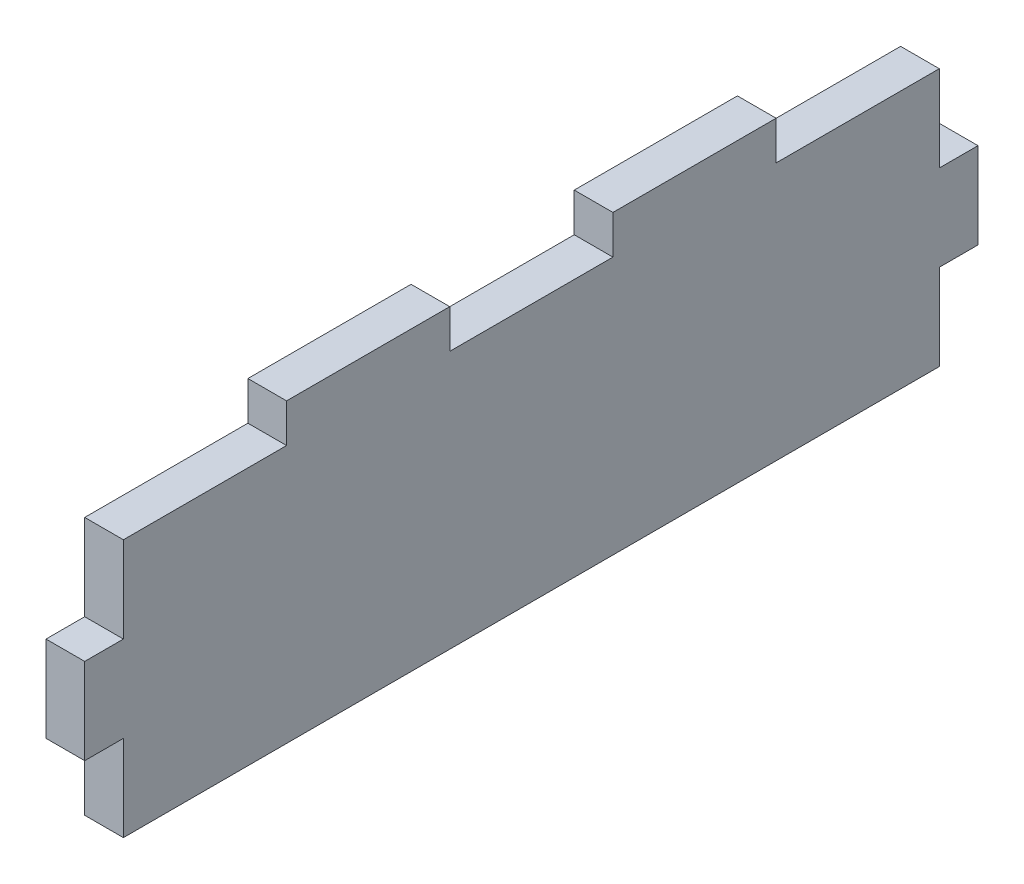
ISO-10303-21;
HEADER;
FILE_DESCRIPTION(('STEP AP214'),'2;1');
FILE_NAME('part.step','',(''),(''),'','','');
FILE_SCHEMA(('AUTOMOTIVE_DESIGN { 1 0 10303 214 1 1 1 1 }'));
ENDSEC;
DATA;
#1=APPLICATION_CONTEXT('core data for automotive mechanical design processes');
#2=APPLICATION_PROTOCOL_DEFINITION('international standard','automotive_design',2000,#1);
#3=PRODUCT_CONTEXT('',#1,'mechanical');
#4=PRODUCT('Part','Part','',(#3));
#5=PRODUCT_RELATED_PRODUCT_CATEGORY('part','',(#4));
#6=PRODUCT_DEFINITION_FORMATION('','',#4);
#7=PRODUCT_DEFINITION_CONTEXT('part definition',#1,'design');
#8=PRODUCT_DEFINITION('design','',#6,#7);
#9=PRODUCT_DEFINITION_SHAPE('','',#8);
#10=(LENGTH_UNIT() NAMED_UNIT(*) SI_UNIT(.MILLI.,.METRE.));
#11=(NAMED_UNIT(*) PLANE_ANGLE_UNIT() SI_UNIT($,.RADIAN.));
#12=(NAMED_UNIT(*) SI_UNIT($,.STERADIAN.) SOLID_ANGLE_UNIT());
#13=UNCERTAINTY_MEASURE_WITH_UNIT(LENGTH_MEASURE(1.E-05),#10,'distance_accuracy_value','');
#14=(GEOMETRIC_REPRESENTATION_CONTEXT(3) GLOBAL_UNCERTAINTY_ASSIGNED_CONTEXT((#13)) GLOBAL_UNIT_ASSIGNED_CONTEXT((#10,
#11,#12)) REPRESENTATION_CONTEXT('',''));
#15=CARTESIAN_POINT('',(0.,0.,0.));
#16=DIRECTION('',(0.,0.,1.));
#17=DIRECTION('',(1.,0.,0.));
#18=AXIS2_PLACEMENT_3D('',#15,#16,#17);
#19=CARTESIAN_POINT('',(-207.5,6.,-63.25));
#20=DIRECTION('',(0.,0.,1.));
#21=DIRECTION('',(1.,0.,0.));
#22=AXIS2_PLACEMENT_3D('',#19,#20,#21);
#23=PLANE('',#22);
#24=DIRECTION('',(0.,1.,0.));
#25=VECTOR('',#24,1.);
#26=CARTESIAN_POINT('',(-213.5,-34.,-63.25));
#27=LINE('',#26,#25);
#28=CARTESIAN_POINT('',(-213.5,-34.,-63.25));
#29=VERTEX_POINT('',#28);
#30=CARTESIAN_POINT('',(-213.5,-20.6666666666667,-63.25));
#31=VERTEX_POINT('',#30);
#32=EDGE_CURVE('E308',#29,#31,#27,.T.);
#33=ORIENTED_EDGE('',*,*,#32,.T.);
#34=DIRECTION('',(1.,0.,0.));
#35=VECTOR('',#34,1.);
#36=CARTESIAN_POINT('',(0.,-20.6666666666667,-63.25));
#37=LINE('',#36,#35);
#38=CARTESIAN_POINT('',(-207.5,-20.6666666666667,-63.25));
#39=VERTEX_POINT('',#38);
#40=EDGE_CURVE('E191',#31,#39,#37,.T.);
#41=ORIENTED_EDGE('',*,*,#40,.T.);
#42=DIRECTION('',(0.,1.,0.));
#43=VECTOR('',#42,1.);
#44=CARTESIAN_POINT('',(-207.5,-34.,-63.25));
#45=LINE('',#44,#43);
#46=CARTESIAN_POINT('',(-207.5,-34.,-63.25));
#47=VERTEX_POINT('',#46);
#48=EDGE_CURVE('E311',#47,#39,#45,.T.);
#49=ORIENTED_EDGE('',*,*,#48,.F.);
#50=DIRECTION('',(-1.,0.,0.));
#51=VECTOR('',#50,1.);
#52=CARTESIAN_POINT('',(0.,-34.,-63.2499999999998));
#53=LINE('',#52,#51);
#54=EDGE_CURVE('E303',#47,#29,#53,.T.);
#55=ORIENTED_EDGE('',*,*,#54,.T.);
#56=EDGE_LOOP('',(#33,#41,#49,#55));
#57=FACE_BOUND('',#56,.T.);
#58=ADVANCED_FACE('F36',(#57),#23,.F.);
#59=CARTESIAN_POINT('',(-207.5,6.,63.25));
#60=DIRECTION('',(0.,0.,-1.));
#61=DIRECTION('',(-1.,0.,0.));
#62=AXIS2_PLACEMENT_3D('',#59,#60,#61);
#63=PLANE('',#62);
#64=DIRECTION('',(-1.,0.,0.));
#65=VECTOR('',#64,1.);
#66=CARTESIAN_POINT('',(0.,-7.33333333333333,63.25));
#67=LINE('',#66,#65);
#68=CARTESIAN_POINT('',(-207.5,-7.33333333333333,63.25));
#69=VERTEX_POINT('',#68);
#70=CARTESIAN_POINT('',(-213.5,-7.33333333333333,63.25));
#71=VERTEX_POINT('',#70);
#72=EDGE_CURVE('E212',#69,#71,#67,.T.);
#73=ORIENTED_EDGE('',*,*,#72,.F.);
#74=DIRECTION('',(0.,1.,0.));
#75=VECTOR('',#74,1.);
#76=CARTESIAN_POINT('',(-207.5,-34.,63.25));
#77=LINE('',#76,#75);
#78=CARTESIAN_POINT('',(-207.5,6.,63.25));
#79=VERTEX_POINT('',#78);
#80=EDGE_CURVE('E317',#69,#79,#77,.T.);
#81=ORIENTED_EDGE('',*,*,#80,.T.);
#82=DIRECTION('',(1.,0.,0.));
#83=VECTOR('',#82,1.);
#84=CARTESIAN_POINT('',(-207.5,6.,63.25));
#85=LINE('',#84,#83);
#86=CARTESIAN_POINT('',(-213.5,6.,63.25));
#87=VERTEX_POINT('',#86);
#88=EDGE_CURVE('E11',#87,#79,#85,.T.);
#89=ORIENTED_EDGE('',*,*,#88,.F.);
#90=DIRECTION('',(0.,1.,0.));
#91=VECTOR('',#90,1.);
#92=CARTESIAN_POINT('',(-213.5,-34.,63.25));
#93=LINE('',#92,#91);
#94=EDGE_CURVE('E59',#71,#87,#93,.T.);
#95=ORIENTED_EDGE('',*,*,#94,.F.);
#96=EDGE_LOOP('',(#73,#81,#89,#95));
#97=FACE_BOUND('',#96,.T.);
#98=ADVANCED_FACE('F346',(#97),#63,.F.);
#99=DIRECTION('',(1.,0.,0.));
#100=VECTOR('',#99,1.);
#101=CARTESIAN_POINT('',(0.,-20.6666666666667,63.25));
#102=LINE('',#101,#100);
#103=CARTESIAN_POINT('',(-213.5,-20.6666666666667,63.25));
#104=VERTEX_POINT('',#103);
#105=CARTESIAN_POINT('',(-207.5,-20.6666666666667,63.25));
#106=VERTEX_POINT('',#105);
#107=EDGE_CURVE('E180',#104,#106,#102,.T.);
#108=ORIENTED_EDGE('',*,*,#107,.F.);
#109=CARTESIAN_POINT('',(-213.5,-34.,63.25));
#110=VERTEX_POINT('',#109);
#111=EDGE_CURVE('E318',#110,#104,#93,.T.);
#112=ORIENTED_EDGE('',*,*,#111,.F.);
#113=DIRECTION('',(1.,0.,0.));
#114=VECTOR('',#113,1.);
#115=CARTESIAN_POINT('',(0.,-34.,63.25));
#116=LINE('',#115,#114);
#117=CARTESIAN_POINT('',(-207.5,-34.,63.25));
#118=VERTEX_POINT('',#117);
#119=EDGE_CURVE('E297',#110,#118,#116,.T.);
#120=ORIENTED_EDGE('',*,*,#119,.T.);
#121=EDGE_CURVE('E315',#118,#106,#77,.T.);
#122=ORIENTED_EDGE('',*,*,#121,.T.);
#123=EDGE_LOOP('',(#108,#112,#120,#122));
#124=FACE_BOUND('',#123,.T.);
#125=ADVANCED_FACE('F351',(#124),#63,.F.);
#126=CARTESIAN_POINT('',(0.,6.,0.));
#127=DIRECTION('',(0.,-1.,0.));
#128=DIRECTION('',(0.,0.,-1.));
#129=AXIS2_PLACEMENT_3D('',#126,#127,#128);
#130=PLANE('',#129);
#131=DIRECTION('',(0.,0.,1.));
#132=VECTOR('',#131,1.);
#133=CARTESIAN_POINT('',(-213.5,6.,0.));
#134=LINE('',#133,#132);
#135=CARTESIAN_POINT('',(-213.5,6.,-63.25));
#136=VERTEX_POINT('',#135);
#137=CARTESIAN_POINT('',(-213.5,6.,-37.9499999999999));
#138=VERTEX_POINT('',#137);
#139=EDGE_CURVE('E298',#136,#138,#134,.T.);
#140=ORIENTED_EDGE('',*,*,#139,.T.);
#141=DIRECTION('',(1.,0.,0.));
#142=VECTOR('',#141,1.);
#143=CARTESIAN_POINT('',(0.,6.,-37.9499999999999));
#144=LINE('',#143,#142);
#145=CARTESIAN_POINT('',(-207.5,6.,-37.9499999999999));
#146=VERTEX_POINT('',#145);
#147=EDGE_CURVE('E233',#138,#146,#144,.T.);
#148=ORIENTED_EDGE('',*,*,#147,.T.);
#149=DIRECTION('',(0.,0.,1.));
#150=VECTOR('',#149,1.);
#151=CARTESIAN_POINT('',(-207.5,6.,63.25));
#152=LINE('',#151,#150);
#153=CARTESIAN_POINT('',(-207.5,6.,-63.25));
#154=VERTEX_POINT('',#153);
#155=EDGE_CURVE('E289',#154,#146,#152,.T.);
#156=ORIENTED_EDGE('',*,*,#155,.F.);
#157=DIRECTION('',(-1.,0.,0.));
#158=VECTOR('',#157,1.);
#159=CARTESIAN_POINT('',(-207.5,6.,-63.25));
#160=LINE('',#159,#158);
#161=EDGE_CURVE('E44',#154,#136,#160,.T.);
#162=ORIENTED_EDGE('',*,*,#161,.T.);
#163=EDGE_LOOP('',(#140,#148,#156,#162));
#164=FACE_BOUND('',#163,.T.);
#165=ADVANCED_FACE('F324',(#164),#130,.F.);
#166=CARTESIAN_POINT('',(-207.5,6.,-12.65));
#167=VERTEX_POINT('',#166);
#168=CARTESIAN_POINT('',(-207.5,6.,12.65));
#169=VERTEX_POINT('',#168);
#170=EDGE_CURVE('E293',#167,#169,#152,.T.);
#171=ORIENTED_EDGE('',*,*,#170,.F.);
#172=DIRECTION('',(-1.,0.,0.));
#173=VECTOR('',#172,1.);
#174=CARTESIAN_POINT('',(0.,6.,-12.65));
#175=LINE('',#174,#173);
#176=CARTESIAN_POINT('',(-213.5,6.,-12.65));
#177=VERTEX_POINT('',#176);
#178=EDGE_CURVE('E238',#167,#177,#175,.T.);
#179=ORIENTED_EDGE('',*,*,#178,.T.);
#180=CARTESIAN_POINT('',(-213.5,6.,12.65));
#181=VERTEX_POINT('',#180);
#182=EDGE_CURVE('E307',#177,#181,#134,.T.);
#183=ORIENTED_EDGE('',*,*,#182,.T.);
#184=DIRECTION('',(1.,0.,0.));
#185=VECTOR('',#184,1.);
#186=CARTESIAN_POINT('',(0.,6.,12.65));
#187=LINE('',#186,#185);
#188=EDGE_CURVE('E261',#181,#169,#187,.T.);
#189=ORIENTED_EDGE('',*,*,#188,.T.);
#190=EDGE_LOOP('',(#171,#179,#183,#189));
#191=FACE_BOUND('',#190,.T.);
#192=ADVANCED_FACE('F337',(#191),#130,.F.);
#193=CARTESIAN_POINT('',(-207.5,-7.33333333333333,-63.25));
#194=VERTEX_POINT('',#193);
#195=EDGE_CURVE('E314',#194,#154,#45,.T.);
#196=ORIENTED_EDGE('',*,*,#195,.F.);
#197=DIRECTION('',(-1.,0.,0.));
#198=VECTOR('',#197,1.);
#199=CARTESIAN_POINT('',(0.,-7.33333333333333,-63.25));
#200=LINE('',#199,#198);
#201=CARTESIAN_POINT('',(-213.5,-7.33333333333333,-63.25));
#202=VERTEX_POINT('',#201);
#203=EDGE_CURVE('E200',#194,#202,#200,.T.);
#204=ORIENTED_EDGE('',*,*,#203,.T.);
#205=EDGE_CURVE('E179',#202,#136,#27,.T.);
#206=ORIENTED_EDGE('',*,*,#205,.T.);
#207=ORIENTED_EDGE('',*,*,#161,.F.);
#208=EDGE_LOOP('',(#196,#204,#206,#207));
#209=FACE_BOUND('',#208,.T.);
#210=ADVANCED_FACE('F38',(#209),#23,.F.);
#211=CARTESIAN_POINT('',(-207.5,6.,37.95));
#212=VERTEX_POINT('',#211);
#213=EDGE_CURVE('E288',#212,#79,#152,.T.);
#214=ORIENTED_EDGE('',*,*,#213,.F.);
#215=DIRECTION('',(-1.,0.,0.));
#216=VECTOR('',#215,1.);
#217=CARTESIAN_POINT('',(0.,6.,37.95));
#218=LINE('',#217,#216);
#219=CARTESIAN_POINT('',(-213.5,6.,37.95));
#220=VERTEX_POINT('',#219);
#221=EDGE_CURVE('E266',#212,#220,#218,.T.);
#222=ORIENTED_EDGE('',*,*,#221,.T.);
#223=EDGE_CURVE('E292',#220,#87,#134,.T.);
#224=ORIENTED_EDGE('',*,*,#223,.T.);
#225=ORIENTED_EDGE('',*,*,#88,.T.);
#226=EDGE_LOOP('',(#214,#222,#224,#225));
#227=FACE_BOUND('',#226,.T.);
#228=ADVANCED_FACE('F336',(#227),#130,.F.);
#229=CARTESIAN_POINT('',(-207.5,-34.,0.));
#230=DIRECTION('',(-1.,0.,0.));
#231=DIRECTION('',(0.,0.,1.));
#232=AXIS2_PLACEMENT_3D('',#229,#230,#231);
#233=PLANE('',#232);
#234=ORIENTED_EDGE('',*,*,#48,.T.);
#235=DIRECTION('',(0.,0.,1.));
#236=VECTOR('',#235,1.);
#237=CARTESIAN_POINT('',(-207.5,-20.6666666666667,-69.25));
#238=LINE('',#237,#236);
#239=CARTESIAN_POINT('',(-207.5,-20.6666666666667,-69.25));
#240=VERTEX_POINT('',#239);
#241=EDGE_CURVE('E205',#240,#39,#238,.T.);
#242=ORIENTED_EDGE('',*,*,#241,.F.);
#243=DIRECTION('',(0.,1.,0.));
#244=VECTOR('',#243,1.);
#245=CARTESIAN_POINT('',(-207.5,0.,-69.25));
#246=LINE('',#245,#244);
#247=CARTESIAN_POINT('',(-207.5,-7.33333333333333,-69.25));
#248=VERTEX_POINT('',#247);
#249=EDGE_CURVE('E194',#240,#248,#246,.T.);
#250=ORIENTED_EDGE('',*,*,#249,.T.);
#251=DIRECTION('',(0.,0.,1.));
#252=VECTOR('',#251,1.);
#253=CARTESIAN_POINT('',(-207.5,-7.33333333333333,-69.25));
#254=LINE('',#253,#252);
#255=EDGE_CURVE('E181',#248,#194,#254,.T.);
#256=ORIENTED_EDGE('',*,*,#255,.T.);
#257=ORIENTED_EDGE('',*,*,#195,.T.);
#258=ORIENTED_EDGE('',*,*,#155,.T.);
#259=DIRECTION('',(0.,-1.,0.));
#260=VECTOR('',#259,1.);
#261=CARTESIAN_POINT('',(-207.5,12.,-37.9499999999999));
#262=LINE('',#261,#260);
#263=CARTESIAN_POINT('',(-207.5,12.,-37.9499999999999));
#264=VERTEX_POINT('',#263);
#265=EDGE_CURVE('E246',#264,#146,#262,.T.);
#266=ORIENTED_EDGE('',*,*,#265,.F.);
#267=DIRECTION('',(0.,0.,1.));
#268=VECTOR('',#267,1.);
#269=CARTESIAN_POINT('',(-207.5,12.,0.));
#270=LINE('',#269,#268);
#271=CARTESIAN_POINT('',(-207.5,12.,-12.65));
#272=VERTEX_POINT('',#271);
#273=EDGE_CURVE('E243',#264,#272,#270,.T.);
#274=ORIENTED_EDGE('',*,*,#273,.T.);
#275=DIRECTION('',(0.,-1.,0.));
#276=VECTOR('',#275,1.);
#277=CARTESIAN_POINT('',(-207.5,12.,-12.65));
#278=LINE('',#277,#276);
#279=EDGE_CURVE('E252',#272,#167,#278,.T.);
#280=ORIENTED_EDGE('',*,*,#279,.T.);
#281=ORIENTED_EDGE('',*,*,#170,.T.);
#282=DIRECTION('',(0.,-1.,0.));
#283=VECTOR('',#282,1.);
#284=CARTESIAN_POINT('',(-207.5,12.,12.65));
#285=LINE('',#284,#283);
#286=CARTESIAN_POINT('',(-207.5,12.,12.65));
#287=VERTEX_POINT('',#286);
#288=EDGE_CURVE('E274',#287,#169,#285,.T.);
#289=ORIENTED_EDGE('',*,*,#288,.F.);
#290=DIRECTION('',(0.,0.,1.));
#291=VECTOR('',#290,1.);
#292=CARTESIAN_POINT('',(-207.5,12.,0.));
#293=LINE('',#292,#291);
#294=CARTESIAN_POINT('',(-207.5,12.,37.95));
#295=VERTEX_POINT('',#294);
#296=EDGE_CURVE('E271',#287,#295,#293,.T.);
#297=ORIENTED_EDGE('',*,*,#296,.T.);
#298=DIRECTION('',(0.,-1.,0.));
#299=VECTOR('',#298,1.);
#300=CARTESIAN_POINT('',(-207.5,12.,37.95));
#301=LINE('',#300,#299);
#302=EDGE_CURVE('E281',#295,#212,#301,.T.);
#303=ORIENTED_EDGE('',*,*,#302,.T.);
#304=ORIENTED_EDGE('',*,*,#213,.T.);
#305=ORIENTED_EDGE('',*,*,#80,.F.);
#306=DIRECTION('',(0.,0.,-1.));
#307=VECTOR('',#306,1.);
#308=CARTESIAN_POINT('',(-207.5,-7.33333333333333,69.25));
#309=LINE('',#308,#307);
#310=CARTESIAN_POINT('',(-207.5,-7.33333333333333,69.25));
#311=VERTEX_POINT('',#310);
#312=EDGE_CURVE('E224',#311,#69,#309,.T.);
#313=ORIENTED_EDGE('',*,*,#312,.F.);
#314=DIRECTION('',(0.,1.,0.));
#315=VECTOR('',#314,1.);
#316=CARTESIAN_POINT('',(-207.5,0.,69.25));
#317=LINE('',#316,#315);
#318=CARTESIAN_POINT('',(-207.5,-20.6666666666667,69.25));
#319=VERTEX_POINT('',#318);
#320=EDGE_CURVE('E214',#319,#311,#317,.T.);
#321=ORIENTED_EDGE('',*,*,#320,.F.);
#322=DIRECTION('',(0.,0.,-1.));
#323=VECTOR('',#322,1.);
#324=CARTESIAN_POINT('',(-207.5,-20.6666666666667,69.25));
#325=LINE('',#324,#323);
#326=EDGE_CURVE('E227',#319,#106,#325,.T.);
#327=ORIENTED_EDGE('',*,*,#326,.T.);
#328=ORIENTED_EDGE('',*,*,#121,.F.);
#329=DIRECTION('',(0.,0.,1.));
#330=VECTOR('',#329,1.);
#331=CARTESIAN_POINT('',(-207.5,-34.,0.));
#332=LINE('',#331,#330);
#333=EDGE_CURVE('E301',#47,#118,#332,.T.);
#334=ORIENTED_EDGE('',*,*,#333,.F.);
#335=EDGE_LOOP('',(#234,#242,#250,#256,#257,#258,#266,#274,#280,#281,#289,#297,#303,#304,#305,
#313,#321,#327,#328,#334));
#336=FACE_BOUND('',#335,.T.);
#337=ADVANCED_FACE('F334',(#336),#233,.F.);
#338=CARTESIAN_POINT('',(-213.5,-34.,0.));
#339=DIRECTION('',(-1.,0.,0.));
#340=DIRECTION('',(0.,0.,1.));
#341=AXIS2_PLACEMENT_3D('',#338,#339,#340);
#342=PLANE('',#341);
#343=ORIENTED_EDGE('',*,*,#139,.F.);
#344=ORIENTED_EDGE('',*,*,#205,.F.);
#345=DIRECTION('',(0.,0.,1.));
#346=VECTOR('',#345,1.);
#347=CARTESIAN_POINT('',(-213.5,-7.33333333333333,-69.25));
#348=LINE('',#347,#346);
#349=CARTESIAN_POINT('',(-213.5,-7.33333333333333,-69.25));
#350=VERTEX_POINT('',#349);
#351=EDGE_CURVE('E51',#350,#202,#348,.T.);
#352=ORIENTED_EDGE('',*,*,#351,.F.);
#353=DIRECTION('',(0.,-1.,0.));
#354=VECTOR('',#353,1.);
#355=CARTESIAN_POINT('',(-213.5,0.,-69.25));
#356=LINE('',#355,#354);
#357=CARTESIAN_POINT('',(-213.5,-20.6666666666667,-69.25));
#358=VERTEX_POINT('',#357);
#359=EDGE_CURVE('E177',#350,#358,#356,.T.);
#360=ORIENTED_EDGE('',*,*,#359,.T.);
#361=DIRECTION('',(0.,0.,1.));
#362=VECTOR('',#361,1.);
#363=CARTESIAN_POINT('',(-213.5,-20.6666666666667,-69.25));
#364=LINE('',#363,#362);
#365=EDGE_CURVE('E199',#358,#31,#364,.T.);
#366=ORIENTED_EDGE('',*,*,#365,.T.);
#367=ORIENTED_EDGE('',*,*,#32,.F.);
#368=DIRECTION('',(0.,0.,1.));
#369=VECTOR('',#368,1.);
#370=CARTESIAN_POINT('',(-213.5,-34.,0.));
#371=LINE('',#370,#369);
#372=EDGE_CURVE('E294',#29,#110,#371,.T.);
#373=ORIENTED_EDGE('',*,*,#372,.T.);
#374=ORIENTED_EDGE('',*,*,#111,.T.);
#375=DIRECTION('',(0.,0.,-1.));
#376=VECTOR('',#375,1.);
#377=CARTESIAN_POINT('',(-213.5,-20.6666666666667,69.25));
#378=LINE('',#377,#376);
#379=CARTESIAN_POINT('',(-213.5,-20.6666666666667,69.25));
#380=VERTEX_POINT('',#379);
#381=EDGE_CURVE('E230',#380,#104,#378,.T.);
#382=ORIENTED_EDGE('',*,*,#381,.F.);
#383=DIRECTION('',(0.,-1.,0.));
#384=VECTOR('',#383,1.);
#385=CARTESIAN_POINT('',(-213.5,0.,69.25));
#386=LINE('',#385,#384);
#387=CARTESIAN_POINT('',(-213.5,-7.33333333333333,69.25));
#388=VERTEX_POINT('',#387);
#389=EDGE_CURVE('E208',#388,#380,#386,.T.);
#390=ORIENTED_EDGE('',*,*,#389,.F.);
#391=DIRECTION('',(0.,0.,-1.));
#392=VECTOR('',#391,1.);
#393=CARTESIAN_POINT('',(-213.5,-7.33333333333333,69.25));
#394=LINE('',#393,#392);
#395=EDGE_CURVE('E218',#388,#71,#394,.T.);
#396=ORIENTED_EDGE('',*,*,#395,.T.);
#397=ORIENTED_EDGE('',*,*,#94,.T.);
#398=ORIENTED_EDGE('',*,*,#223,.F.);
#399=DIRECTION('',(0.,-1.,0.));
#400=VECTOR('',#399,1.);
#401=CARTESIAN_POINT('',(-213.5,12.,37.95));
#402=LINE('',#401,#400);
#403=CARTESIAN_POINT('',(-213.5,12.,37.95));
#404=VERTEX_POINT('',#403);
#405=EDGE_CURVE('E283',#404,#220,#402,.T.);
#406=ORIENTED_EDGE('',*,*,#405,.F.);
#407=DIRECTION('',(0.,0.,1.));
#408=VECTOR('',#407,1.);
#409=CARTESIAN_POINT('',(-213.5,12.,0.));
#410=LINE('',#409,#408);
#411=CARTESIAN_POINT('',(-213.5,12.,12.65));
#412=VERTEX_POINT('',#411);
#413=EDGE_CURVE('E265',#412,#404,#410,.T.);
#414=ORIENTED_EDGE('',*,*,#413,.F.);
#415=DIRECTION('',(0.,-1.,0.));
#416=VECTOR('',#415,1.);
#417=CARTESIAN_POINT('',(-213.5,12.,12.65));
#418=LINE('',#417,#416);
#419=EDGE_CURVE('E285',#412,#181,#418,.T.);
#420=ORIENTED_EDGE('',*,*,#419,.T.);
#421=ORIENTED_EDGE('',*,*,#182,.F.);
#422=DIRECTION('',(0.,-1.,0.));
#423=VECTOR('',#422,1.);
#424=CARTESIAN_POINT('',(-213.5,12.,-12.65));
#425=LINE('',#424,#423);
#426=CARTESIAN_POINT('',(-213.5,12.,-12.65));
#427=VERTEX_POINT('',#426);
#428=EDGE_CURVE('E255',#427,#177,#425,.T.);
#429=ORIENTED_EDGE('',*,*,#428,.F.);
#430=DIRECTION('',(0.,0.,1.));
#431=VECTOR('',#430,1.);
#432=CARTESIAN_POINT('',(-213.5,12.,0.));
#433=LINE('',#432,#431);
#434=CARTESIAN_POINT('',(-213.5,12.,-37.9499999999999));
#435=VERTEX_POINT('',#434);
#436=EDGE_CURVE('E237',#435,#427,#433,.T.);
#437=ORIENTED_EDGE('',*,*,#436,.F.);
#438=DIRECTION('',(0.,-1.,0.));
#439=VECTOR('',#438,1.);
#440=CARTESIAN_POINT('',(-213.5,12.,-37.9499999999999));
#441=LINE('',#440,#439);
#442=EDGE_CURVE('E258',#435,#138,#441,.T.);
#443=ORIENTED_EDGE('',*,*,#442,.T.);
#444=EDGE_LOOP('',(#343,#344,#352,#360,#366,#367,#373,#374,#382,#390,#396,#397,#398,#406,#414,
#420,#421,#429,#437,#443));
#445=FACE_BOUND('',#444,.T.);
#446=ADVANCED_FACE('F176',(#445),#342,.T.);
#447=CARTESIAN_POINT('',(0.,-34.,0.));
#448=DIRECTION('',(0.,1.,0.));
#449=DIRECTION('',(0.,0.,1.));
#450=AXIS2_PLACEMENT_3D('',#447,#448,#449);
#451=PLANE('',#450);
#452=ORIENTED_EDGE('',*,*,#372,.F.);
#453=ORIENTED_EDGE('',*,*,#54,.F.);
#454=ORIENTED_EDGE('',*,*,#333,.T.);
#455=ORIENTED_EDGE('',*,*,#119,.F.);
#456=EDGE_LOOP('',(#452,#453,#454,#455));
#457=FACE_BOUND('',#456,.T.);
#458=ADVANCED_FACE('F357',(#457),#451,.F.);
#459=CARTESIAN_POINT('',(0.,12.,12.65));
#460=DIRECTION('',(0.,0.,-1.));
#461=DIRECTION('',(-1.,0.,0.));
#462=AXIS2_PLACEMENT_3D('',#459,#460,#461);
#463=PLANE('',#462);
#464=ORIENTED_EDGE('',*,*,#188,.F.);
#465=ORIENTED_EDGE('',*,*,#419,.F.);
#466=DIRECTION('',(1.,0.,0.));
#467=VECTOR('',#466,1.);
#468=CARTESIAN_POINT('',(0.,12.,12.65));
#469=LINE('',#468,#467);
#470=EDGE_CURVE('E262',#412,#287,#469,.T.);
#471=ORIENTED_EDGE('',*,*,#470,.T.);
#472=ORIENTED_EDGE('',*,*,#288,.T.);
#473=EDGE_LOOP('',(#464,#465,#471,#472));
#474=FACE_BOUND('',#473,.T.);
#475=ADVANCED_FACE('F386',(#474),#463,.T.);
#476=CARTESIAN_POINT('',(0.,12.,37.95));
#477=DIRECTION('',(0.,0.,1.));
#478=DIRECTION('',(1.,0.,0.));
#479=AXIS2_PLACEMENT_3D('',#476,#477,#478);
#480=PLANE('',#479);
#481=ORIENTED_EDGE('',*,*,#221,.F.);
#482=ORIENTED_EDGE('',*,*,#302,.F.);
#483=DIRECTION('',(-1.,0.,0.));
#484=VECTOR('',#483,1.);
#485=CARTESIAN_POINT('',(0.,12.,37.95));
#486=LINE('',#485,#484);
#487=EDGE_CURVE('E268',#295,#404,#486,.T.);
#488=ORIENTED_EDGE('',*,*,#487,.T.);
#489=ORIENTED_EDGE('',*,*,#405,.T.);
#490=EDGE_LOOP('',(#481,#482,#488,#489));
#491=FACE_BOUND('',#490,.T.);
#492=ADVANCED_FACE('F409',(#491),#480,.T.);
#493=CARTESIAN_POINT('',(0.,12.,0.));
#494=DIRECTION('',(0.,1.,0.));
#495=DIRECTION('',(0.,0.,1.));
#496=AXIS2_PLACEMENT_3D('',#493,#494,#495);
#497=PLANE('',#496);
#498=ORIENTED_EDGE('',*,*,#470,.F.);
#499=ORIENTED_EDGE('',*,*,#413,.T.);
#500=ORIENTED_EDGE('',*,*,#487,.F.);
#501=ORIENTED_EDGE('',*,*,#296,.F.);
#502=EDGE_LOOP('',(#498,#499,#500,#501));
#503=FACE_BOUND('',#502,.T.);
#504=ADVANCED_FACE('F406',(#503),#497,.T.);
#505=CARTESIAN_POINT('',(0.,12.,-37.9499999999999));
#506=DIRECTION('',(0.,0.,-1.));
#507=DIRECTION('',(-1.,0.,0.));
#508=AXIS2_PLACEMENT_3D('',#505,#506,#507);
#509=PLANE('',#508);
#510=ORIENTED_EDGE('',*,*,#147,.F.);
#511=ORIENTED_EDGE('',*,*,#442,.F.);
#512=DIRECTION('',(1.,0.,0.));
#513=VECTOR('',#512,1.);
#514=CARTESIAN_POINT('',(0.,12.,-37.9499999999999));
#515=LINE('',#514,#513);
#516=EDGE_CURVE('E234',#435,#264,#515,.T.);
#517=ORIENTED_EDGE('',*,*,#516,.T.);
#518=ORIENTED_EDGE('',*,*,#265,.T.);
#519=EDGE_LOOP('',(#510,#511,#517,#518));
#520=FACE_BOUND('',#519,.T.);
#521=ADVANCED_FACE('F332',(#520),#509,.T.);
#522=CARTESIAN_POINT('',(0.,12.,-12.65));
#523=DIRECTION('',(0.,0.,1.));
#524=DIRECTION('',(1.,0.,0.));
#525=AXIS2_PLACEMENT_3D('',#522,#523,#524);
#526=PLANE('',#525);
#527=ORIENTED_EDGE('',*,*,#178,.F.);
#528=ORIENTED_EDGE('',*,*,#279,.F.);
#529=DIRECTION('',(-1.,0.,0.));
#530=VECTOR('',#529,1.);
#531=CARTESIAN_POINT('',(0.,12.,-12.65));
#532=LINE('',#531,#530);
#533=EDGE_CURVE('E240',#272,#427,#532,.T.);
#534=ORIENTED_EDGE('',*,*,#533,.T.);
#535=ORIENTED_EDGE('',*,*,#428,.T.);
#536=EDGE_LOOP('',(#527,#528,#534,#535));
#537=FACE_BOUND('',#536,.T.);
#538=ADVANCED_FACE('F391',(#537),#526,.T.);
#539=CARTESIAN_POINT('',(0.,12.,0.));
#540=DIRECTION('',(0.,1.,0.));
#541=DIRECTION('',(0.,0.,1.));
#542=AXIS2_PLACEMENT_3D('',#539,#540,#541);
#543=PLANE('',#542);
#544=ORIENTED_EDGE('',*,*,#516,.F.);
#545=ORIENTED_EDGE('',*,*,#436,.T.);
#546=ORIENTED_EDGE('',*,*,#533,.F.);
#547=ORIENTED_EDGE('',*,*,#273,.F.);
#548=EDGE_LOOP('',(#544,#545,#546,#547));
#549=FACE_BOUND('',#548,.T.);
#550=ADVANCED_FACE('F393',(#549),#543,.T.);
#551=CARTESIAN_POINT('',(0.,-20.6666666666667,69.25));
#552=DIRECTION('',(0.,1.,0.));
#553=DIRECTION('',(0.,0.,1.));
#554=AXIS2_PLACEMENT_3D('',#551,#552,#553);
#555=PLANE('',#554);
#556=ORIENTED_EDGE('',*,*,#107,.T.);
#557=ORIENTED_EDGE('',*,*,#326,.F.);
#558=DIRECTION('',(1.,0.,0.));
#559=VECTOR('',#558,1.);
#560=CARTESIAN_POINT('',(0.,-20.6666666666667,69.25));
#561=LINE('',#560,#559);
#562=EDGE_CURVE('E211',#380,#319,#561,.T.);
#563=ORIENTED_EDGE('',*,*,#562,.F.);
#564=ORIENTED_EDGE('',*,*,#381,.T.);
#565=EDGE_LOOP('',(#556,#557,#563,#564));
#566=FACE_BOUND('',#565,.T.);
#567=ADVANCED_FACE('F364',(#566),#555,.F.);
#568=CARTESIAN_POINT('',(0.,-7.33333333333333,69.25));
#569=DIRECTION('',(0.,-1.,0.));
#570=DIRECTION('',(0.,0.,-1.));
#571=AXIS2_PLACEMENT_3D('',#568,#569,#570);
#572=PLANE('',#571);
#573=ORIENTED_EDGE('',*,*,#72,.T.);
#574=ORIENTED_EDGE('',*,*,#395,.F.);
#575=DIRECTION('',(-1.,0.,0.));
#576=VECTOR('',#575,1.);
#577=CARTESIAN_POINT('',(0.,-7.33333333333333,69.25));
#578=LINE('',#577,#576);
#579=EDGE_CURVE('E216',#311,#388,#578,.T.);
#580=ORIENTED_EDGE('',*,*,#579,.F.);
#581=ORIENTED_EDGE('',*,*,#312,.T.);
#582=EDGE_LOOP('',(#573,#574,#580,#581));
#583=FACE_BOUND('',#582,.T.);
#584=ADVANCED_FACE('F374',(#583),#572,.F.);
#585=CARTESIAN_POINT('',(0.,0.,69.25));
#586=DIRECTION('',(0.,0.,1.));
#587=DIRECTION('',(1.,0.,0.));
#588=AXIS2_PLACEMENT_3D('',#585,#586,#587);
#589=PLANE('',#588);
#590=ORIENTED_EDGE('',*,*,#389,.T.);
#591=ORIENTED_EDGE('',*,*,#562,.T.);
#592=ORIENTED_EDGE('',*,*,#320,.T.);
#593=ORIENTED_EDGE('',*,*,#579,.T.);
#594=EDGE_LOOP('',(#590,#591,#592,#593));
#595=FACE_BOUND('',#594,.T.);
#596=ADVANCED_FACE('F368',(#595),#589,.T.);
#597=CARTESIAN_POINT('',(0.,-7.33333333333333,-69.25));
#598=DIRECTION('',(0.,1.,0.));
#599=DIRECTION('',(0.,0.,1.));
#600=AXIS2_PLACEMENT_3D('',#597,#598,#599);
#601=PLANE('',#600);
#602=ORIENTED_EDGE('',*,*,#203,.F.);
#603=ORIENTED_EDGE('',*,*,#255,.F.);
#604=DIRECTION('',(-1.,0.,0.));
#605=VECTOR('',#604,1.);
#606=CARTESIAN_POINT('',(0.,-7.33333333333333,-69.25));
#607=LINE('',#606,#605);
#608=EDGE_CURVE('E187',#248,#350,#607,.T.);
#609=ORIENTED_EDGE('',*,*,#608,.T.);
#610=ORIENTED_EDGE('',*,*,#351,.T.);
#611=EDGE_LOOP('',(#602,#603,#609,#610));
#612=FACE_BOUND('',#611,.T.);
#613=ADVANCED_FACE('F193',(#612),#601,.T.);
#614=CARTESIAN_POINT('',(0.,-20.6666666666667,-69.25));
#615=DIRECTION('',(0.,-1.,0.));
#616=DIRECTION('',(0.,0.,-1.));
#617=AXIS2_PLACEMENT_3D('',#614,#615,#616);
#618=PLANE('',#617);
#619=ORIENTED_EDGE('',*,*,#40,.F.);
#620=ORIENTED_EDGE('',*,*,#365,.F.);
#621=DIRECTION('',(1.,0.,0.));
#622=VECTOR('',#621,1.);
#623=CARTESIAN_POINT('',(0.,-20.6666666666667,-69.25));
#624=LINE('',#623,#622);
#625=EDGE_CURVE('E190',#358,#240,#624,.T.);
#626=ORIENTED_EDGE('',*,*,#625,.T.);
#627=ORIENTED_EDGE('',*,*,#241,.T.);
#628=EDGE_LOOP('',(#619,#620,#626,#627));
#629=FACE_BOUND('',#628,.T.);
#630=ADVANCED_FACE('F535',(#629),#618,.T.);
#631=CARTESIAN_POINT('',(0.,0.,-69.25));
#632=DIRECTION('',(0.,0.,-1.));
#633=DIRECTION('',(1.,0.,0.));
#634=AXIS2_PLACEMENT_3D('',#631,#632,#633);
#635=PLANE('',#634);
#636=ORIENTED_EDGE('',*,*,#359,.F.);
#637=ORIENTED_EDGE('',*,*,#608,.F.);
#638=ORIENTED_EDGE('',*,*,#249,.F.);
#639=ORIENTED_EDGE('',*,*,#625,.F.);
#640=EDGE_LOOP('',(#636,#637,#638,#639));
#641=FACE_BOUND('',#640,.T.);
#642=ADVANCED_FACE('F185',(#641),#635,.T.);
#643=CLOSED_SHELL('',(#58,#98,#125,#165,#192,#210,#228,#337,#446,#458,#475,#492,#504,#521,#538,
#550,#567,#584,#596,#613,#630,#642));
#644=MANIFOLD_SOLID_BREP('B2',#643);
#645=ADVANCED_BREP_SHAPE_REPRESENTATION('',(#18,#644),#14);
#646=SHAPE_DEFINITION_REPRESENTATION(#9,#645);
ENDSEC;
END-ISO-10303-21;
